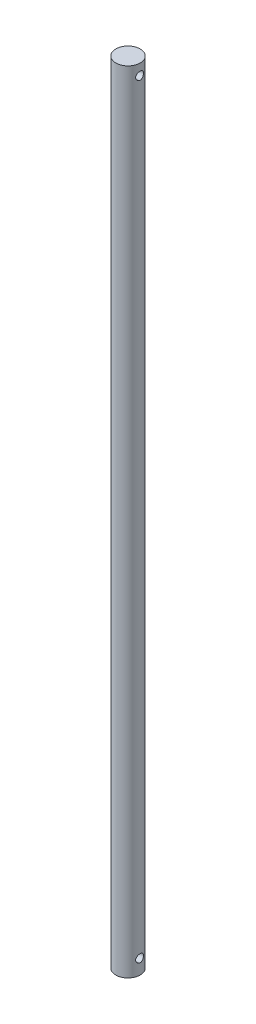
ISO-10303-21;
HEADER;
FILE_DESCRIPTION(('STEP AP214'),'2;1');
FILE_NAME('part.step','',(''),(''),'','','');
FILE_SCHEMA(('AUTOMOTIVE_DESIGN { 1 0 10303 214 1 1 1 1 }'));
ENDSEC;
DATA;
#1=APPLICATION_CONTEXT('core data for automotive mechanical design processes');
#2=APPLICATION_PROTOCOL_DEFINITION('international standard','automotive_design',2000,#1);
#3=PRODUCT_CONTEXT('',#1,'mechanical');
#4=PRODUCT('Part','Part','',(#3));
#5=PRODUCT_RELATED_PRODUCT_CATEGORY('part','',(#4));
#6=PRODUCT_DEFINITION_FORMATION('','',#4);
#7=PRODUCT_DEFINITION_CONTEXT('part definition',#1,'design');
#8=PRODUCT_DEFINITION('design','',#6,#7);
#9=PRODUCT_DEFINITION_SHAPE('','',#8);
#10=(LENGTH_UNIT() NAMED_UNIT(*) SI_UNIT(.MILLI.,.METRE.));
#11=(NAMED_UNIT(*) PLANE_ANGLE_UNIT() SI_UNIT($,.RADIAN.));
#12=(NAMED_UNIT(*) SI_UNIT($,.STERADIAN.) SOLID_ANGLE_UNIT());
#13=UNCERTAINTY_MEASURE_WITH_UNIT(LENGTH_MEASURE(1.E-05),#10,'distance_accuracy_value','');
#14=(GEOMETRIC_REPRESENTATION_CONTEXT(3) GLOBAL_UNCERTAINTY_ASSIGNED_CONTEXT((#13)) GLOBAL_UNIT_ASSIGNED_CONTEXT((#10,
#11,#12)) REPRESENTATION_CONTEXT('',''));
#15=CARTESIAN_POINT('',(0.,0.,0.));
#16=DIRECTION('',(0.,0.,1.));
#17=DIRECTION('',(1.,0.,0.));
#18=AXIS2_PLACEMENT_3D('',#15,#16,#17);
#19=CARTESIAN_POINT('',(0.,647.7,0.));
#20=DIRECTION('',(0.,-1.,0.));
#21=DIRECTION('',(0.,0.,-1.));
#22=AXIS2_PLACEMENT_3D('',#19,#20,#21);
#23=PLANE('',#22);
#24=CARTESIAN_POINT('',(0.,647.7,0.));
#25=DIRECTION('',(0.,-1.,0.));
#26=DIRECTION('',(0.,0.,-1.));
#27=AXIS2_PLACEMENT_3D('',#24,#25,#26);
#28=CIRCLE('',#27,10.);
#29=CARTESIAN_POINT('',(0.,647.7,-10.));
#30=VERTEX_POINT('',#29);
#31=EDGE_CURVE('E76',#30,#30,#28,.T.);
#32=ORIENTED_EDGE('',*,*,#31,.F.);
#33=EDGE_LOOP('',(#32));
#34=FACE_BOUND('',#33,.T.);
#35=ADVANCED_FACE('F34',(#34),#23,.F.);
#36=CARTESIAN_POINT('',(0.,0.,0.));
#37=DIRECTION('',(0.,-1.,0.));
#38=DIRECTION('',(0.,0.,-1.));
#39=AXIS2_PLACEMENT_3D('',#36,#37,#38);
#40=CYLINDRICAL_SURFACE('',#39,10.);
#41=CARTESIAN_POINT('',(-9.47417542586161,12.,-3.2));
#42=CARTESIAN_POINT('',(-9.47417597596529,11.8252675240217,-3.19999948748241));
#43=CARTESIAN_POINT('',(-9.47906219195895,11.6505289924909,-3.18563986333058));
#44=CARTESIAN_POINT('',(-9.49798743796998,11.3062008247597,-3.12875538344883));
#45=CARTESIAN_POINT('',(-9.51202859144488,11.1366123926612,-3.08622399333436));
#46=CARTESIAN_POINT('',(-9.54751402925731,10.8076237967184,-2.97462043765107));
#47=CARTESIAN_POINT('',(-9.56894471348064,10.6482055493959,-2.90559700333832));
#48=CARTESIAN_POINT('',(-9.61677531099797,10.3431647179559,-2.74313268908806));
#49=CARTESIAN_POINT('',(-9.64317618145327,10.1975447992626,-2.6496871045708));
#50=CARTESIAN_POINT('',(-9.69903937529536,9.91898720973653,-2.43742483906297));
#51=CARTESIAN_POINT('',(-9.72857356061098,9.7866196690505,-2.31787869458639));
#52=CARTESIAN_POINT('',(-9.78676560427288,9.54342714827223,-2.05836824466033));
#53=CARTESIAN_POINT('',(-9.81542333344964,9.43260533075562,-1.91840094697461));
#54=CARTESIAN_POINT('',(-9.86945906171126,9.23310922940001,-1.61789884492554));
#55=CARTESIAN_POINT('',(-9.89474262289425,9.14502570138148,-1.45695337572198));
#56=CARTESIAN_POINT('',(-9.93833941290931,8.99740287206874,-1.12158438701709));
#57=CARTESIAN_POINT('',(-9.95665436412906,8.93785651647464,-0.947164210813368));
#58=CARTESIAN_POINT('',(-9.98374156030321,8.85091244154329,-0.595769420238151));
#59=CARTESIAN_POINT('',(-9.99280261988359,8.82253948467678,-0.419058777748383));
#60=CARTESIAN_POINT('',(-10.0013829623879,8.79565378899779,-0.0631682598409807));
#61=CARTESIAN_POINT('',(-10.0009045165927,8.79713394239642,0.116011017661705));
#62=CARTESIAN_POINT('',(-9.99065895983166,8.82927900394473,0.46487498333391));
#63=CARTESIAN_POINT('',(-9.98122856275874,8.85888599568119,0.634668632607027));
#64=CARTESIAN_POINT('',(-9.9545558794711,8.94470364648235,0.966736587299292));
#65=CARTESIAN_POINT('',(-9.93731307593572,9.00091606731206,1.12901039398623));
#66=CARTESIAN_POINT('',(-9.89650924003928,9.13900646503544,1.44382789922966));
#67=CARTESIAN_POINT('',(-9.87287146660126,9.22119836318636,1.59622354374657));
#68=CARTESIAN_POINT('',(-9.82175766841644,9.40866041379786,1.88538287482271));
#69=CARTESIAN_POINT('',(-9.79428063837074,9.51393661494408,2.02214245001061));
#70=CARTESIAN_POINT('',(-9.73698938358848,9.74997528346341,2.28245105048536));
#71=CARTESIAN_POINT('',(-9.70712548953852,9.88164872610375,2.40516427559648));
#72=CARTESIAN_POINT('',(-9.64945167915512,10.1639765219705,2.62702414716751));
#73=CARTESIAN_POINT('',(-9.62164203019799,10.3146333391531,2.72616772956348));
#74=CARTESIAN_POINT('',(-9.57096714718232,10.6331134805527,2.89911048763164));
#75=CARTESIAN_POINT('',(-9.54816651520166,10.8011241506088,2.97258500870697));
#76=CARTESIAN_POINT('',(-9.51084502816611,11.1480416126375,3.0899292349732));
#77=CARTESIAN_POINT('',(-9.49632102597734,11.3269442343381,3.13381019408681));
#78=CARTESIAN_POINT('',(-9.47790063591906,11.6825278202122,3.18907786384485));
#79=CARTESIAN_POINT('',(-9.47358408719401,11.8589872966575,3.20175015508952));
#80=CARTESIAN_POINT('',(-9.47489797544712,12.2115285410692,3.19786135813747));
#81=CARTESIAN_POINT('',(-9.48052678275551,12.3876103661848,3.18130505940762));
#82=CARTESIAN_POINT('',(-9.50068088288853,12.7287540546895,3.12058026689559));
#83=CARTESIAN_POINT('',(-9.51492688986554,12.8939882933978,3.07727773142789));
#84=CARTESIAN_POINT('',(-9.55041030162889,13.2148223194797,2.96531424580086));
#85=CARTESIAN_POINT('',(-9.5716488826307,13.3704204807409,2.89664902916759));
#86=CARTESIAN_POINT('',(-9.61950884733194,13.6726956943237,2.73357916810069));
#87=CARTESIAN_POINT('',(-9.64627168789195,13.8189691176186,2.63846893911339));
#88=CARTESIAN_POINT('',(-9.7018783866565,14.0939468443676,2.42602399530557));
#89=CARTESIAN_POINT('',(-9.73072281011003,14.2226463480166,2.30868322966909));
#90=CARTESIAN_POINT('',(-9.78877025045593,14.4646382212684,2.04900195609836));
#91=CARTESIAN_POINT('',(-9.81793369813727,14.5770096031674,1.90579198298008));
#92=CARTESIAN_POINT('',(-9.87207731058433,14.7761701545534,1.60183776977253));
#93=CARTESIAN_POINT('',(-9.89705765393074,14.862960416243,1.44109427868983));
#94=CARTESIAN_POINT('',(-9.93988578323935,15.0076719945354,1.10756752180852));
#95=CARTESIAN_POINT('',(-9.95778352281728,15.0657962368275,0.934879051113338));
#96=CARTESIAN_POINT('',(-9.9846484932616,15.1519682082215,0.581499965650404));
#97=CARTESIAN_POINT('',(-9.99361866877497,15.1800258546538,0.400812009966613));
#98=CARTESIAN_POINT('',(-10.0014130503861,15.2044314157995,0.0450212703250095));
#99=CARTESIAN_POINT('',(-10.0006619581795,15.2021066300598,-0.129982208988878));
#100=CARTESIAN_POINT('',(-9.990125511942,15.1690458304435,-0.476990875820558));
#101=CARTESIAN_POINT('',(-9.98034079636578,15.1383118243993,-0.648996274353536));
#102=CARTESIAN_POINT('',(-9.95297868315481,15.0501634584681,-0.982806083184512));
#103=CARTESIAN_POINT('',(-9.93550954998843,14.9931192551087,-1.14471773714632));
#104=CARTESIAN_POINT('',(-9.89457847944627,14.8543067808554,-1.45674507420833));
#105=CARTESIAN_POINT('',(-9.87111549176467,14.7725341763308,-1.60685868389727));
#106=CARTESIAN_POINT('',(-9.81961108395006,14.5832777844292,-1.89675571330933));
#107=CARTESIAN_POINT('',(-9.7914380507585,14.4749935275912,-2.03599290546539));
#108=CARTESIAN_POINT('',(-9.73404767984889,14.2371814483193,-2.29475841560531));
#109=CARTESIAN_POINT('',(-9.70483002448992,14.1076471206118,-2.41428067572616));
#110=CARTESIAN_POINT('',(-9.64743064993378,13.8255467087277,-2.63448393047812));
#111=CARTESIAN_POINT('',(-9.61932168852476,13.6723299958571,-2.73435281796463));
#112=CARTESIAN_POINT('',(-9.56861935653345,13.3504305886542,-2.90682777364151));
#113=CARTESIAN_POINT('',(-9.54602402656828,13.1817534179145,-2.97944353174495));
#114=CARTESIAN_POINT('',(-9.51051736579668,12.8460343177833,-3.09083212772817));
#115=CARTESIAN_POINT('',(-9.49703147588917,12.6797296882286,-3.13164502117033));
#116=CARTESIAN_POINT('',(-9.4788614617525,12.342284402362,-3.18622544347289));
#117=CARTESIAN_POINT('',(-9.47417488705192,12.1711451059091,-3.20000050199527));
#118=CARTESIAN_POINT('',(-9.47417542586161,12.,-3.2));
#119=B_SPLINE_CURVE_WITH_KNOTS('',3,(#41,#42,#43,#44,#45,#46,#47,#48,#49,#50,#51,#52,#53,#54,
#55,#56,#57,#58,#59,#60,#61,#62,#63,#64,#65,#66,#67,#68,#69,#70,#71,#72,#73,#74,#75,#76,#77,#78,
#79,#80,#81,#82,#83,#84,#85,#86,#87,#88,#89,#90,#91,#92,#93,#94,#95,#96,#97,#98,#99,#100,#101,
#102,#103,#104,#105,#106,#107,#108,#109,#110,#111,#112,#113,#114,#115,#116,#117,#118),
.UNSPECIFIED.,.T.,.F.,(4,2,2,2,2,2,2,2,2,2,2,2,2,2,2,2,2,2,2,2,2,2,2,2,2,2,2,2,2,2,2,2,2,2,2,2,
2,2,4),(0.,0.523564674172284,1.0472508306648,1.56997826478679,2.09280646922704,2.63272434433933,
3.17272141122681,3.72558754982145,4.2783169510497,4.8132134883914,5.34798267261194,
5.86340254805635,6.37885655848016,6.90079380151692,7.42286796941231,7.96770136648513,
8.51260555345556,9.06417123638576,9.61552704991908,10.143759826717,10.6719060540588,
11.1837891269488,11.6957583473223,12.2229730659105,12.7503314910767,13.3007734478392,
13.8511918997182,14.3976559377886,14.9439396716354,15.4664410564686,15.9889055161438,
16.5042337176069,17.0196522822778,17.5531298275023,18.0867709917439,18.6392120202663,
19.1914564406026,19.7044148674947,20.2172304223009),.UNSPECIFIED.);
#120=CARTESIAN_POINT('',(-9.47417542586161,12.,-3.2));
#121=VERTEX_POINT('',#120);
#122=EDGE_CURVE('E10',#121,#121,#119,.T.);
#123=ORIENTED_EDGE('',*,*,#122,.F.);
#124=EDGE_LOOP('',(#123));
#125=FACE_BOUND('',#124,.T.);
#126=CARTESIAN_POINT('',(9.47417542586161,12.,-3.2));
#127=CARTESIAN_POINT('',(9.47417597596529,12.1747324759783,-3.19999948748241));
#128=CARTESIAN_POINT('',(9.47906219195895,12.3494710075091,-3.18563986333058));
#129=CARTESIAN_POINT('',(9.49798743796998,12.6937991752403,-3.12875538344883));
#130=CARTESIAN_POINT('',(9.51202859144488,12.8633876073388,-3.08622399333436));
#131=CARTESIAN_POINT('',(9.54751402925731,13.1923762032816,-2.97462043765107));
#132=CARTESIAN_POINT('',(9.56894471348064,13.3517944506041,-2.90559700333832));
#133=CARTESIAN_POINT('',(9.61677531099797,13.6568352820441,-2.74313268908806));
#134=CARTESIAN_POINT('',(9.64317618145327,13.8024552007374,-2.6496871045708));
#135=CARTESIAN_POINT('',(9.69903937529536,14.0810127902635,-2.43742483906297));
#136=CARTESIAN_POINT('',(9.72857356061098,14.2133803309495,-2.31787869458639));
#137=CARTESIAN_POINT('',(9.78676560427288,14.4565728517278,-2.05836824466034));
#138=CARTESIAN_POINT('',(9.81542333344964,14.5673946692444,-1.91840094697461));
#139=CARTESIAN_POINT('',(9.86945906171126,14.7668907706,-1.61789884492554));
#140=CARTESIAN_POINT('',(9.89474262289425,14.8549742986185,-1.45695337572198));
#141=CARTESIAN_POINT('',(9.93833941290931,15.0025971279313,-1.12158438701709));
#142=CARTESIAN_POINT('',(9.95665436412906,15.0621434835254,-0.947164210813368));
#143=CARTESIAN_POINT('',(9.98374156030321,15.1490875584567,-0.595769420238151));
#144=CARTESIAN_POINT('',(9.99280261988359,15.1774605153232,-0.419058777748383));
#145=CARTESIAN_POINT('',(10.0013829623879,15.2043462110022,-0.0631682598409807));
#146=CARTESIAN_POINT('',(10.0009045165927,15.2028660576036,0.116011017661705));
#147=CARTESIAN_POINT('',(9.99065895983166,15.1707209960553,0.46487498333391));
#148=CARTESIAN_POINT('',(9.98122856275874,15.1411140043188,0.634668632607027));
#149=CARTESIAN_POINT('',(9.9545558794711,15.0552963535177,0.966736587299292));
#150=CARTESIAN_POINT('',(9.93731307593572,14.9990839326879,1.12901039398623));
#151=CARTESIAN_POINT('',(9.89650924003928,14.8609935349646,1.44382789922966));
#152=CARTESIAN_POINT('',(9.87287146660126,14.7788016368136,1.59622354374657));
#153=CARTESIAN_POINT('',(9.82175766841644,14.5913395862021,1.88538287482271));
#154=CARTESIAN_POINT('',(9.79428063837075,14.4860633850559,2.02214245001061));
#155=CARTESIAN_POINT('',(9.73698938358848,14.2500247165366,2.28245105048536));
#156=CARTESIAN_POINT('',(9.70712548953852,14.1183512738962,2.40516427559648));
#157=CARTESIAN_POINT('',(9.64945167915512,13.8360234780295,2.62702414716751));
#158=CARTESIAN_POINT('',(9.62164203019799,13.6853666608469,2.72616772956348));
#159=CARTESIAN_POINT('',(9.57096714718232,13.3668865194473,2.89911048763164));
#160=CARTESIAN_POINT('',(9.54816651520166,13.1988758493912,2.97258500870697));
#161=CARTESIAN_POINT('',(9.51084502816611,12.8519583873625,3.0899292349732));
#162=CARTESIAN_POINT('',(9.49632102597734,12.6730557656619,3.13381019408681));
#163=CARTESIAN_POINT('',(9.47790063591906,12.3174721797878,3.18907786384485));
#164=CARTESIAN_POINT('',(9.47358408719401,12.1410127033425,3.20175015508952));
#165=CARTESIAN_POINT('',(9.47489797544712,11.7884714589308,3.19786135813747));
#166=CARTESIAN_POINT('',(9.48052678275551,11.6123896338152,3.18130505940762));
#167=CARTESIAN_POINT('',(9.50068088288853,11.2712459453105,3.12058026689559));
#168=CARTESIAN_POINT('',(9.51492688986554,11.1060117066022,3.07727773142789));
#169=CARTESIAN_POINT('',(9.55041030162889,10.7851776805203,2.96531424580086));
#170=CARTESIAN_POINT('',(9.5716488826307,10.6295795192591,2.89664902916759));
#171=CARTESIAN_POINT('',(9.61950884733194,10.3273043056763,2.7335791681007));
#172=CARTESIAN_POINT('',(9.64627168789195,10.1810308823814,2.6384689391134));
#173=CARTESIAN_POINT('',(9.7018783866565,9.90605315563245,2.42602399530557));
#174=CARTESIAN_POINT('',(9.73072281011003,9.77735365198339,2.30868322966909));
#175=CARTESIAN_POINT('',(9.78877025045593,9.53536177873159,2.04900195609836));
#176=CARTESIAN_POINT('',(9.81793369813727,9.42299039683255,1.90579198298008));
#177=CARTESIAN_POINT('',(9.87207731058433,9.22382984544657,1.60183776977253));
#178=CARTESIAN_POINT('',(9.89705765393074,9.13703958375704,1.44109427868983));
#179=CARTESIAN_POINT('',(9.93988578323935,8.99232800546458,1.10756752180852));
#180=CARTESIAN_POINT('',(9.95778352281728,8.93420376317245,0.934879051113338));
#181=CARTESIAN_POINT('',(9.9846484932616,8.84803179177853,0.581499965650404));
#182=CARTESIAN_POINT('',(9.99361866877497,8.81997414534619,0.400812009966613));
#183=CARTESIAN_POINT('',(10.0014130503861,8.7955685842005,0.0450212703250094));
#184=CARTESIAN_POINT('',(10.0006619581795,8.7978933699402,-0.129982208988878));
#185=CARTESIAN_POINT('',(9.990125511942,8.83095416955647,-0.476990875820558));
#186=CARTESIAN_POINT('',(9.98034079636578,8.86168817560073,-0.648996274353537));
#187=CARTESIAN_POINT('',(9.95297868315481,8.94983654153192,-0.982806083184512));
#188=CARTESIAN_POINT('',(9.93550954998843,9.0068807448913,-1.14471773714632));
#189=CARTESIAN_POINT('',(9.89457847944627,9.14569321914456,-1.45674507420833));
#190=CARTESIAN_POINT('',(9.87111549176467,9.22746582366924,-1.60685868389727));
#191=CARTESIAN_POINT('',(9.81961108395006,9.41672221557081,-1.89675571330932));
#192=CARTESIAN_POINT('',(9.7914380507585,9.52500647240882,-2.03599290546539));
#193=CARTESIAN_POINT('',(9.73404767984889,9.76281855168073,-2.29475841560531));
#194=CARTESIAN_POINT('',(9.70483002448992,9.89235287938818,-2.41428067572616));
#195=CARTESIAN_POINT('',(9.64743064993378,10.1744532912723,-2.63448393047812));
#196=CARTESIAN_POINT('',(9.61932168852476,10.3276700041429,-2.73435281796463));
#197=CARTESIAN_POINT('',(9.56861935653345,10.6495694113458,-2.90682777364151));
#198=CARTESIAN_POINT('',(9.54602402656828,10.8182465820855,-2.97944353174495));
#199=CARTESIAN_POINT('',(9.51051736579668,11.1539656822166,-3.09083212772817));
#200=CARTESIAN_POINT('',(9.49703147588917,11.3202703117714,-3.13164502117034));
#201=CARTESIAN_POINT('',(9.4788614617525,11.657715597638,-3.18622544347289));
#202=CARTESIAN_POINT('',(9.47417488705192,11.8288548940909,-3.20000050199527));
#203=CARTESIAN_POINT('',(9.47417542586161,12.,-3.2));
#204=B_SPLINE_CURVE_WITH_KNOTS('',3,(#126,#127,#128,#129,#130,#131,#132,#133,#134,#135,#136,
#137,#138,#139,#140,#141,#142,#143,#144,#145,#146,#147,#148,#149,#150,#151,#152,#153,#154,#155,
#156,#157,#158,#159,#160,#161,#162,#163,#164,#165,#166,#167,#168,#169,#170,#171,#172,#173,#174,
#175,#176,#177,#178,#179,#180,#181,#182,#183,#184,#185,#186,#187,#188,#189,#190,#191,#192,#193,
#194,#195,#196,#197,#198,#199,#200,#201,#202,#203),.UNSPECIFIED.,.T.,.F.,(4,2,2,2,2,2,2,2,2,2,2,
2,2,2,2,2,2,2,2,2,2,2,2,2,2,2,2,2,2,2,2,2,2,2,2,2,2,2,4),(0.,0.523564674172285,1.0472508306648,
1.56997826478679,2.09280646922704,2.63272434433933,3.17272141122681,3.72558754982145,
4.2783169510497,4.8132134883914,5.34798267261194,5.86340254805635,6.37885655848016,
6.90079380151692,7.42286796941231,7.96770136648513,8.51260555345556,9.06417123638576,
9.61552704991908,10.143759826717,10.6719060540588,11.1837891269488,11.6957583473223,
12.2229730659105,12.7503314910767,13.3007734478392,13.8511918997182,14.3976559377886,
14.9439396716354,15.4664410564686,15.9889055161438,16.5042337176069,17.0196522822778,
17.5531298275023,18.0867709917439,18.6392120202663,19.1914564406026,19.7044148674947,
20.2172304223009),.UNSPECIFIED.);
#205=CARTESIAN_POINT('',(9.47417542586161,12.,-3.2));
#206=VERTEX_POINT('',#205);
#207=EDGE_CURVE('E43',#206,#206,#204,.T.);
#208=ORIENTED_EDGE('',*,*,#207,.F.);
#209=EDGE_LOOP('',(#208));
#210=FACE_BOUND('',#209,.T.);
#211=CARTESIAN_POINT('',(-9.47417542586162,638.7,-3.19999999999998));
#212=CARTESIAN_POINT('',(-9.47417597596529,638.525267524022,-3.19999948748239));
#213=CARTESIAN_POINT('',(-9.47906219195896,638.350528992491,-3.18563986333055));
#214=CARTESIAN_POINT('',(-9.49798743796999,638.00620082476,-3.1287553834488));
#215=CARTESIAN_POINT('',(-9.51202859144489,637.836612392661,-3.08622399333433));
#216=CARTESIAN_POINT('',(-9.54751402925732,637.507623796718,-2.97462043765103));
#217=CARTESIAN_POINT('',(-9.56894471348066,637.348205549396,-2.90559700333827));
#218=CARTESIAN_POINT('',(-9.61677531099798,637.043164717956,-2.74313268908801));
#219=CARTESIAN_POINT('',(-9.64317618145328,636.897544799263,-2.64968710457076));
#220=CARTESIAN_POINT('',(-9.69903937529536,636.618987209737,-2.43742483906294));
#221=CARTESIAN_POINT('',(-9.72857356061098,636.48661966905,-2.31787869458636));
#222=CARTESIAN_POINT('',(-9.78676560427289,636.243427148272,-2.05836824466032));
#223=CARTESIAN_POINT('',(-9.81542333344964,636.132605330756,-1.91840094697459));
#224=CARTESIAN_POINT('',(-9.86945906171126,635.9331092294,-1.61789884492553));
#225=CARTESIAN_POINT('',(-9.89474262289426,635.845025701381,-1.45695337572197));
#226=CARTESIAN_POINT('',(-9.93833941290931,635.697402872069,-1.12158438701706));
#227=CARTESIAN_POINT('',(-9.95665436412907,635.637856516475,-0.9471642108133));
#228=CARTESIAN_POINT('',(-9.98374156030322,635.550912441543,-0.595769420238056));
#229=CARTESIAN_POINT('',(-9.9928026198836,635.522539484677,-0.419058777748291));
#230=CARTESIAN_POINT('',(-10.0013829623879,635.495653788998,-0.0631682598408839));
#231=CARTESIAN_POINT('',(-10.0009045165927,635.497133942396,0.116011017661809));
#232=CARTESIAN_POINT('',(-9.99065895983166,635.529279003945,0.464874983334018));
#233=CARTESIAN_POINT('',(-9.98122856275873,635.558885995681,0.634668632607131));
#234=CARTESIAN_POINT('',(-9.9545558794711,635.644703646482,0.966736587299379));
#235=CARTESIAN_POINT('',(-9.93731307593572,635.700916067312,1.1290103939863));
#236=CARTESIAN_POINT('',(-9.89650924003927,635.839006465035,1.44382789922972));
#237=CARTESIAN_POINT('',(-9.87287146660125,635.921198363186,1.59622354374663));
#238=CARTESIAN_POINT('',(-9.82175766841643,636.108660413798,1.88538287482276));
#239=CARTESIAN_POINT('',(-9.79428063837073,636.213936614944,2.02214245001066));
#240=CARTESIAN_POINT('',(-9.73698938358846,636.449975283463,2.28245105048545));
#241=CARTESIAN_POINT('',(-9.70712548953849,636.581648726104,2.40516427559661));
#242=CARTESIAN_POINT('',(-9.64945167915508,636.863976521971,2.62702414716763));
#243=CARTESIAN_POINT('',(-9.62164203019797,637.014633339153,2.72616772956356));
#244=CARTESIAN_POINT('',(-9.57096714718231,637.333113480553,2.89911048763166));
#245=CARTESIAN_POINT('',(-9.54816651520165,637.501124150609,2.97258500870698));
#246=CARTESIAN_POINT('',(-9.51084502816611,637.848041612638,3.08992923497321));
#247=CARTESIAN_POINT('',(-9.49632102597734,638.026944234338,3.13381019408681));
#248=CARTESIAN_POINT('',(-9.47790063591906,638.382527820212,3.18907786384485));
#249=CARTESIAN_POINT('',(-9.47358408719401,638.558987296658,3.20175015508951));
#250=CARTESIAN_POINT('',(-9.47489797544713,638.911528541069,3.19786135813744));
#251=CARTESIAN_POINT('',(-9.48052678275552,639.087610366185,3.18130505940759));
#252=CARTESIAN_POINT('',(-9.50068088288855,639.42875405469,3.12058026689555));
#253=CARTESIAN_POINT('',(-9.51492688986555,639.593988293398,3.07727773142784));
#254=CARTESIAN_POINT('',(-9.55041030162891,639.91482231948,2.96531424580079));
#255=CARTESIAN_POINT('',(-9.57164888263072,640.070420480741,2.89664902916751));
#256=CARTESIAN_POINT('',(-9.61950884733196,640.372695694324,2.73357916810061));
#257=CARTESIAN_POINT('',(-9.64627168789197,640.518969117619,2.63846893911332));
#258=CARTESIAN_POINT('',(-9.70187838665651,640.793946844367,2.42602399530553));
#259=CARTESIAN_POINT('',(-9.73072281011004,640.922646348017,2.30868322966906));
#260=CARTESIAN_POINT('',(-9.78877025045594,641.164638221268,2.04900195609833));
#261=CARTESIAN_POINT('',(-9.81793369813728,641.277009603167,1.90579198298002));
#262=CARTESIAN_POINT('',(-9.87207731058434,641.476170154553,1.60183776977245));
#263=CARTESIAN_POINT('',(-9.89705765393075,641.562960416243,1.44109427868976));
#264=CARTESIAN_POINT('',(-9.93988578323935,641.707671994535,1.10756752180846));
#265=CARTESIAN_POINT('',(-9.95778352281729,641.765796236828,0.934879051113273));
#266=CARTESIAN_POINT('',(-9.9846484932616,641.851968208221,0.581499965650328));
#267=CARTESIAN_POINT('',(-9.99361866877497,641.880025854654,0.400812009966532));
#268=CARTESIAN_POINT('',(-10.0014130503861,641.904431415799,0.045021270324921));
#269=CARTESIAN_POINT('',(-10.0006619581795,641.90210663006,-0.129982208988969));
#270=CARTESIAN_POINT('',(-9.990125511942,641.869045830443,-0.476990875820647));
#271=CARTESIAN_POINT('',(-9.98034079636578,641.838311824399,-0.64899627435362));
#272=CARTESIAN_POINT('',(-9.9529786831548,641.750163458468,-0.9828060831846));
#273=CARTESIAN_POINT('',(-9.93550954998841,641.693119255109,-1.14471773714642));
#274=CARTESIAN_POINT('',(-9.89457847944626,641.554306780855,-1.45674507420842));
#275=CARTESIAN_POINT('',(-9.87111549176466,641.472534176331,-1.60685868389734));
#276=CARTESIAN_POINT('',(-9.81961108395005,641.283277784429,-1.89675571330938));
#277=CARTESIAN_POINT('',(-9.79143805075849,641.174993527591,-2.03599290546545));
#278=CARTESIAN_POINT('',(-9.73404767984887,640.937181448319,-2.29475841560538));
#279=CARTESIAN_POINT('',(-9.7048300244899,640.807647120612,-2.41428067572624));
#280=CARTESIAN_POINT('',(-9.64743064993377,640.525546708728,-2.63448393047817));
#281=CARTESIAN_POINT('',(-9.61932168852475,640.372329995857,-2.73435281796466));
#282=CARTESIAN_POINT('',(-9.56861935653344,640.050430588654,-2.90682777364154));
#283=CARTESIAN_POINT('',(-9.54602402656827,639.881753417914,-2.97944353174498));
#284=CARTESIAN_POINT('',(-9.51051736579667,639.546034317783,-3.09083212772819));
#285=CARTESIAN_POINT('',(-9.49703147588917,639.379729688228,-3.13164502117034));
#286=CARTESIAN_POINT('',(-9.47886146175251,639.042284402362,-3.18622544347288));
#287=CARTESIAN_POINT('',(-9.47417488705192,638.871145105909,-3.20000050199525));
#288=CARTESIAN_POINT('',(-9.47417542586162,638.7,-3.19999999999998));
#289=B_SPLINE_CURVE_WITH_KNOTS('',3,(#211,#212,#213,#214,#215,#216,#217,#218,#219,#220,#221,
#222,#223,#224,#225,#226,#227,#228,#229,#230,#231,#232,#233,#234,#235,#236,#237,#238,#239,#240,
#241,#242,#243,#244,#245,#246,#247,#248,#249,#250,#251,#252,#253,#254,#255,#256,#257,#258,#259,
#260,#261,#262,#263,#264,#265,#266,#267,#268,#269,#270,#271,#272,#273,#274,#275,#276,#277,#278,
#279,#280,#281,#282,#283,#284,#285,#286,#287,#288),.UNSPECIFIED.,.T.,.F.,(4,2,2,2,2,2,2,2,2,2,2,
2,2,2,2,2,2,2,2,2,2,2,2,2,2,2,2,2,2,2,2,2,2,2,2,2,2,2,4),(0.,0.523564674172302,1.04725083066484,
1.56997826478683,2.09280646922705,2.63272434433929,3.17272141122675,3.72558754982144,
4.27831695104973,4.81321348839144,5.34798267261199,5.86340254805638,6.37885655848018,
6.90079380151691,7.42286796941231,7.96770136648531,8.51260555345563,9.06417123638574,
9.61552704991906,10.143759826717,10.6719060540588,11.1837891269489,11.6957583473223,
12.2229730659105,12.7503314910767,13.3007734478391,13.8511918997182,14.3976559377886,
14.9439396716354,15.4664410564686,15.9889055161438,16.5042337176069,17.0196522822778,
17.5531298275022,18.0867709917439,18.6392120202663,19.1914564406026,19.7044148674947,
20.2172304223008),.UNSPECIFIED.);
#290=CARTESIAN_POINT('',(-9.47417542586162,638.7,-3.19999999999998));
#291=VERTEX_POINT('',#290);
#292=EDGE_CURVE('E47',#291,#291,#289,.T.);
#293=ORIENTED_EDGE('',*,*,#292,.F.);
#294=EDGE_LOOP('',(#293));
#295=FACE_BOUND('',#294,.T.);
#296=CARTESIAN_POINT('',(9.47417542586162,638.7,-3.19999999999998));
#297=CARTESIAN_POINT('',(9.47417597596529,638.874732475978,-3.19999948748239));
#298=CARTESIAN_POINT('',(9.47906219195896,639.049471007509,-3.18563986333055));
#299=CARTESIAN_POINT('',(9.49798743796999,639.39379917524,-3.1287553834488));
#300=CARTESIAN_POINT('',(9.5120285914449,639.563387607339,-3.08622399333432));
#301=CARTESIAN_POINT('',(9.54751402925731,639.892376203282,-2.97462043765104));
#302=CARTESIAN_POINT('',(9.56894471348064,640.051794450604,-2.90559700333831));
#303=CARTESIAN_POINT('',(9.61677531099797,640.356835282044,-2.74313268908805));
#304=CARTESIAN_POINT('',(9.64317618145328,640.502455200737,-2.64968710457077));
#305=CARTESIAN_POINT('',(9.69903937529537,640.781012790263,-2.43742483906293));
#306=CARTESIAN_POINT('',(9.72857356061098,640.913380330949,-2.31787869458636));
#307=CARTESIAN_POINT('',(9.78676560427288,641.156572851728,-2.05836824466032));
#308=CARTESIAN_POINT('',(9.81542333344964,641.267394669244,-1.91840094697459));
#309=CARTESIAN_POINT('',(9.86945906171126,641.4668907706,-1.61789884492553));
#310=CARTESIAN_POINT('',(9.89474262289426,641.554974298618,-1.45695337572197));
#311=CARTESIAN_POINT('',(9.93833941290931,641.702597127931,-1.12158438701706));
#312=CARTESIAN_POINT('',(9.95665436412907,641.762143483525,-0.947164210813301));
#313=CARTESIAN_POINT('',(9.98374156030322,641.849087558457,-0.595769420238054));
#314=CARTESIAN_POINT('',(9.9928026198836,641.877460515323,-0.419058777748286));
#315=CARTESIAN_POINT('',(10.0013829623879,641.904346211002,-0.0631682598408783));
#316=CARTESIAN_POINT('',(10.0009045165927,641.902866057604,0.116011017661812));
#317=CARTESIAN_POINT('',(9.99065895983166,641.870720996055,0.464874983334018));
#318=CARTESIAN_POINT('',(9.98122856275873,641.841114004319,0.634668632607131));
#319=CARTESIAN_POINT('',(9.9545558794711,641.755296353518,0.966736587299379));
#320=CARTESIAN_POINT('',(9.93731307593572,641.699083932688,1.1290103939863));
#321=CARTESIAN_POINT('',(9.89650924003927,641.560993534964,1.44382789922972));
#322=CARTESIAN_POINT('',(9.87287146660125,641.478801636814,1.59622354374663));
#323=CARTESIAN_POINT('',(9.82175766841643,641.291339586202,1.88538287482276));
#324=CARTESIAN_POINT('',(9.79428063837073,641.186063385056,2.02214245001066));
#325=CARTESIAN_POINT('',(9.73698938358848,640.950024716537,2.28245105048537));
#326=CARTESIAN_POINT('',(9.70712548953853,640.818351273896,2.40516427559645));
#327=CARTESIAN_POINT('',(9.64945167915512,640.536023478029,2.62702414716749));
#328=CARTESIAN_POINT('',(9.62164203019799,640.385366660847,2.72616772956351));
#329=CARTESIAN_POINT('',(9.57096714718231,640.066886519447,2.89911048763167));
#330=CARTESIAN_POINT('',(9.54816651520165,639.898875849391,2.97258500870698));
#331=CARTESIAN_POINT('',(9.51084502816611,639.551958387362,3.0899292349732));
#332=CARTESIAN_POINT('',(9.49632102597734,639.373055765662,3.13381019408681));
#333=CARTESIAN_POINT('',(9.47790063591906,639.017472179788,3.18907786384485));
#334=CARTESIAN_POINT('',(9.47358408719401,638.841012703342,3.20175015508951));
#335=CARTESIAN_POINT('',(9.47489797544713,638.488471458931,3.19786135813744));
#336=CARTESIAN_POINT('',(9.48052678275552,638.312389633815,3.18130505940759));
#337=CARTESIAN_POINT('',(9.50068088288855,637.97124594531,3.12058026689555));
#338=CARTESIAN_POINT('',(9.51492688986555,637.806011706602,3.07727773142784));
#339=CARTESIAN_POINT('',(9.55041030162891,637.48517768052,2.96531424580079));
#340=CARTESIAN_POINT('',(9.57164888263072,637.329579519259,2.89664902916751));
#341=CARTESIAN_POINT('',(9.61950884733196,637.027304305676,2.73357916810061));
#342=CARTESIAN_POINT('',(9.64627168789197,636.881030882381,2.63846893911332));
#343=CARTESIAN_POINT('',(9.70187838665651,636.606053155632,2.42602399530553));
#344=CARTESIAN_POINT('',(9.73072281011004,636.477353651983,2.30868322966906));
#345=CARTESIAN_POINT('',(9.78877025045594,636.235361778732,2.04900195609833));
#346=CARTESIAN_POINT('',(9.81793369813728,636.122990396833,1.90579198298002));
#347=CARTESIAN_POINT('',(9.87207731058434,635.923829845447,1.60183776977245));
#348=CARTESIAN_POINT('',(9.89705765393075,635.837039583757,1.44109427868976));
#349=CARTESIAN_POINT('',(9.93988578323935,635.692328005464,1.10756752180846));
#350=CARTESIAN_POINT('',(9.95778352281729,635.634203763172,0.934879051113273));
#351=CARTESIAN_POINT('',(9.9846484932616,635.548031791778,0.581499965650328));
#352=CARTESIAN_POINT('',(9.99361866877497,635.519974145346,0.400812009966532));
#353=CARTESIAN_POINT('',(10.0014130503861,635.495568584201,0.045021270324921));
#354=CARTESIAN_POINT('',(10.0006619581795,635.49789336994,-0.129982208988969));
#355=CARTESIAN_POINT('',(9.990125511942,635.530954169556,-0.476990875820647));
#356=CARTESIAN_POINT('',(9.98034079636578,635.561688175601,-0.64899627435362));
#357=CARTESIAN_POINT('',(9.9529786831548,635.649836541532,-0.9828060831846));
#358=CARTESIAN_POINT('',(9.93550954998841,635.706880744891,-1.14471773714642));
#359=CARTESIAN_POINT('',(9.89457847944626,635.845693219145,-1.45674507420842));
#360=CARTESIAN_POINT('',(9.87111549176466,635.927465823669,-1.60685868389734));
#361=CARTESIAN_POINT('',(9.81961108395005,636.116722215571,-1.89675571330938));
#362=CARTESIAN_POINT('',(9.79143805075849,636.225006472409,-2.03599290546545));
#363=CARTESIAN_POINT('',(9.73404767984887,636.462818551681,-2.29475841560538));
#364=CARTESIAN_POINT('',(9.7048300244899,636.592352879388,-2.41428067572624));
#365=CARTESIAN_POINT('',(9.64743064993377,636.874453291272,-2.63448393047817));
#366=CARTESIAN_POINT('',(9.61932168852475,637.027670004143,-2.73435281796466));
#367=CARTESIAN_POINT('',(9.56861935653344,637.349569411346,-2.90682777364154));
#368=CARTESIAN_POINT('',(9.54602402656827,637.518246582086,-2.97944353174498));
#369=CARTESIAN_POINT('',(9.51051736579667,637.853965682217,-3.09083212772819));
#370=CARTESIAN_POINT('',(9.49703147588917,638.020270311771,-3.13164502117034));
#371=CARTESIAN_POINT('',(9.47886146175251,638.357715597638,-3.18622544347288));
#372=CARTESIAN_POINT('',(9.47417488705192,638.528854894091,-3.20000050199525));
#373=CARTESIAN_POINT('',(9.47417542586162,638.7,-3.19999999999998));
#374=B_SPLINE_CURVE_WITH_KNOTS('',3,(#296,#297,#298,#299,#300,#301,#302,#303,#304,#305,#306,
#307,#308,#309,#310,#311,#312,#313,#314,#315,#316,#317,#318,#319,#320,#321,#322,#323,#324,#325,
#326,#327,#328,#329,#330,#331,#332,#333,#334,#335,#336,#337,#338,#339,#340,#341,#342,#343,#344,
#345,#346,#347,#348,#349,#350,#351,#352,#353,#354,#355,#356,#357,#358,#359,#360,#361,#362,#363,
#364,#365,#366,#367,#368,#369,#370,#371,#372,#373),.UNSPECIFIED.,.T.,.F.,(4,2,2,2,2,2,2,2,2,2,2,
2,2,2,2,2,2,2,2,2,2,2,2,2,2,2,2,2,2,2,2,2,2,2,2,2,2,2,4),(0.,0.523564674172302,1.04725083066484,
1.56997826478681,2.09280646922706,2.6327243443393,3.17272141122675,3.72558754982145,
4.27831695104974,4.81321348839145,5.347982672612,5.86340254805639,6.37885655848018,
6.90079380151692,7.42286796941231,7.96770136648501,8.51260555345563,9.06417123638574,
9.61552704991906,10.143759826717,10.6719060540588,11.1837891269489,11.6957583473223,
12.2229730659105,12.7503314910767,13.3007734478391,13.8511918997182,14.3976559377886,
14.9439396716354,15.4664410564686,15.9889055161438,16.5042337176069,17.0196522822778,
17.5531298275022,18.0867709917439,18.6392120202663,19.1914564406026,19.7044148674947,
20.2172304223008),.UNSPECIFIED.);
#375=CARTESIAN_POINT('',(9.47417542586162,638.7,-3.19999999999998));
#376=VERTEX_POINT('',#375);
#377=EDGE_CURVE('E51',#376,#376,#374,.T.);
#378=ORIENTED_EDGE('',*,*,#377,.F.);
#379=EDGE_LOOP('',(#378));
#380=FACE_BOUND('',#379,.T.);
#381=ORIENTED_EDGE('',*,*,#31,.T.);
#382=EDGE_LOOP('',(#381));
#383=FACE_BOUND('',#382,.T.);
#384=CARTESIAN_POINT('',(0.,0.,0.));
#385=DIRECTION('',(0.,-1.,0.));
#386=DIRECTION('',(0.,0.,-1.));
#387=AXIS2_PLACEMENT_3D('',#384,#385,#386);
#388=CIRCLE('',#387,10.);
#389=CARTESIAN_POINT('',(0.,0.,-10.));
#390=VERTEX_POINT('',#389);
#391=EDGE_CURVE('E79',#390,#390,#388,.T.);
#392=ORIENTED_EDGE('',*,*,#391,.F.);
#393=EDGE_LOOP('',(#392));
#394=FACE_BOUND('',#393,.T.);
#395=ADVANCED_FACE('F59',(#125,#210,#295,#380,#383,#394),#40,.T.);
#396=CARTESIAN_POINT('',(0.,0.,0.));
#397=DIRECTION('',(0.,-1.,0.));
#398=DIRECTION('',(0.,0.,-1.));
#399=AXIS2_PLACEMENT_3D('',#396,#397,#398);
#400=PLANE('',#399);
#401=ORIENTED_EDGE('',*,*,#391,.T.);
#402=EDGE_LOOP('',(#401));
#403=FACE_BOUND('',#402,.T.);
#404=ADVANCED_FACE('F69',(#403),#400,.T.);
#405=CARTESIAN_POINT('',(-10.,638.7,0.));
#406=DIRECTION('',(1.,0.,0.));
#407=DIRECTION('',(0.,0.,-1.));
#408=AXIS2_PLACEMENT_3D('',#405,#406,#407);
#409=CYLINDRICAL_SURFACE('',#408,3.19999999999998);
#410=ORIENTED_EDGE('',*,*,#292,.T.);
#411=EDGE_LOOP('',(#410));
#412=FACE_BOUND('',#411,.T.);
#413=ORIENTED_EDGE('',*,*,#377,.T.);
#414=EDGE_LOOP('',(#413));
#415=FACE_BOUND('',#414,.T.);
#416=ADVANCED_FACE('F65',(#412,#415),#409,.F.);
#417=CARTESIAN_POINT('',(-10.,12.,0.));
#418=DIRECTION('',(1.,0.,0.));
#419=DIRECTION('',(0.,0.,-1.));
#420=AXIS2_PLACEMENT_3D('',#417,#418,#419);
#421=CYLINDRICAL_SURFACE('',#420,3.2);
#422=ORIENTED_EDGE('',*,*,#122,.T.);
#423=EDGE_LOOP('',(#422));
#424=FACE_BOUND('',#423,.T.);
#425=ORIENTED_EDGE('',*,*,#207,.T.);
#426=EDGE_LOOP('',(#425));
#427=FACE_BOUND('',#426,.T.);
#428=ADVANCED_FACE('F62',(#424,#427),#421,.F.);
#429=CLOSED_SHELL('',(#35,#395,#404,#416,#428));
#430=MANIFOLD_SOLID_BREP('B2',#429);
#431=ADVANCED_BREP_SHAPE_REPRESENTATION('',(#18,#430),#14);
#432=SHAPE_DEFINITION_REPRESENTATION(#9,#431);
ENDSEC;
END-ISO-10303-21;
